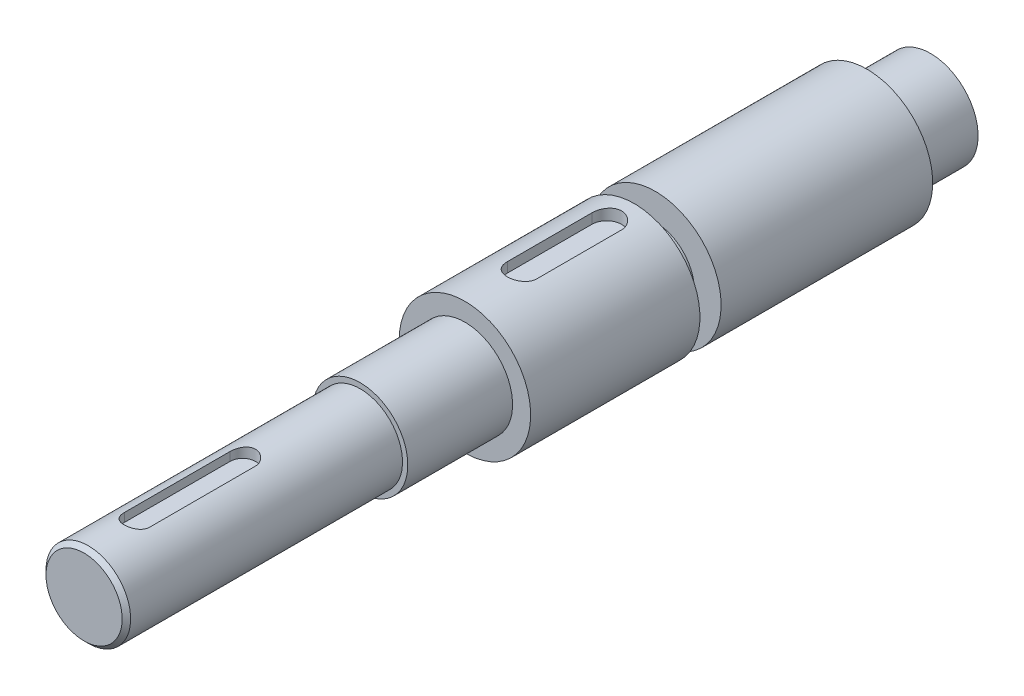
ISO-10303-21;
HEADER;
FILE_DESCRIPTION(('STEP AP214'),'2;1');
FILE_NAME('part.step','',(''),(''),'','','');
FILE_SCHEMA(('AUTOMOTIVE_DESIGN { 1 0 10303 214 1 1 1 1 }'));
ENDSEC;
DATA;
#1=APPLICATION_CONTEXT('core data for automotive mechanical design processes');
#2=APPLICATION_PROTOCOL_DEFINITION('international standard','automotive_design',2000,#1);
#3=PRODUCT_CONTEXT('',#1,'mechanical');
#4=PRODUCT('Part','Part','',(#3));
#5=PRODUCT_RELATED_PRODUCT_CATEGORY('part','',(#4));
#6=PRODUCT_DEFINITION_FORMATION('','',#4);
#7=PRODUCT_DEFINITION_CONTEXT('part definition',#1,'design');
#8=PRODUCT_DEFINITION('design','',#6,#7);
#9=PRODUCT_DEFINITION_SHAPE('','',#8);
#10=(LENGTH_UNIT() NAMED_UNIT(*) SI_UNIT(.MILLI.,.METRE.));
#11=(NAMED_UNIT(*) PLANE_ANGLE_UNIT() SI_UNIT($,.RADIAN.));
#12=(NAMED_UNIT(*) SI_UNIT($,.STERADIAN.) SOLID_ANGLE_UNIT());
#13=UNCERTAINTY_MEASURE_WITH_UNIT(LENGTH_MEASURE(1.E-05),#10,'distance_accuracy_value','');
#14=(GEOMETRIC_REPRESENTATION_CONTEXT(3) GLOBAL_UNCERTAINTY_ASSIGNED_CONTEXT((#13)) GLOBAL_UNIT_ASSIGNED_CONTEXT((#10,
#11,#12)) REPRESENTATION_CONTEXT('',''));
#15=CARTESIAN_POINT('',(0.,0.,0.));
#16=DIRECTION('',(0.,0.,1.));
#17=DIRECTION('',(1.,0.,0.));
#18=AXIS2_PLACEMENT_3D('',#15,#16,#17);
#19=CARTESIAN_POINT('',(0.,0.,0.));
#20=DIRECTION('',(0.,0.,-1.));
#21=DIRECTION('',(-1.,0.,0.));
#22=AXIS2_PLACEMENT_3D('',#19,#20,#21);
#23=CYLINDRICAL_SURFACE('',#22,31.0462161840448);
#24=CARTESIAN_POINT('',(0.,0.,140.));
#25=DIRECTION('',(0.,0.,-1.));
#26=DIRECTION('',(-1.,0.,0.));
#27=AXIS2_PLACEMENT_3D('',#24,#25,#26);
#28=CIRCLE('',#27,31.0462161840448);
#29=CARTESIAN_POINT('',(-31.0462161840448,0.,140.));
#30=VERTEX_POINT('',#29);
#31=EDGE_CURVE('E199',#30,#30,#28,.T.);
#32=ORIENTED_EDGE('',*,*,#31,.F.);
#33=EDGE_LOOP('',(#32));
#34=FACE_BOUND('',#33,.T.);
#35=CARTESIAN_POINT('',(0.,0.,220.));
#36=DIRECTION('',(0.,0.,-1.));
#37=DIRECTION('',(-1.,0.,0.));
#38=AXIS2_PLACEMENT_3D('',#35,#36,#37);
#39=CIRCLE('',#38,31.0462161840448);
#40=CARTESIAN_POINT('',(-31.0462161840447,0.,220.));
#41=VERTEX_POINT('',#40);
#42=EDGE_CURVE('E203',#41,#41,#39,.T.);
#43=ORIENTED_EDGE('',*,*,#42,.T.);
#44=EDGE_LOOP('',(#43));
#45=FACE_BOUND('',#44,.T.);
#46=CARTESIAN_POINT('',(7.00000000000025,30.2467773381965,153.));
#47=CARTESIAN_POINT('',(7.0000239199198,30.2467574455834,152.805798291076));
#48=CARTESIAN_POINT('',(6.9919194202463,30.2486469948294,152.611603461748));
#49=CARTESIAN_POINT('',(6.95962897307481,30.2561003798817,152.224653673244));
#50=CARTESIAN_POINT('',(6.93544535717896,30.2616636829632,152.031898509402));
#51=CARTESIAN_POINT('',(6.87122788254649,30.2763073077124,151.649529930742));
#52=CARTESIAN_POINT('',(6.83122167125654,30.285381494077,151.459911633672));
#53=CARTESIAN_POINT('',(6.73568941566803,30.3067721313322,151.084813621907));
#54=CARTESIAN_POINT('',(6.68016323652484,30.3190886103934,150.899333943186));
#55=CARTESIAN_POINT('',(6.55403762524998,30.3466025580059,150.533837009143));
#56=CARTESIAN_POINT('',(6.4834411993063,30.3617994519093,150.353818672569));
#57=CARTESIAN_POINT('',(6.32767380472778,30.3946445663342,150.000356997992));
#58=CARTESIAN_POINT('',(6.24249743726262,30.41229369444,149.826916124735));
#59=CARTESIAN_POINT('',(6.058226302515,30.4495363213094,149.487861704012));
#60=CARTESIAN_POINT('',(5.95913445500535,30.4691294119346,149.322246524262));
#61=CARTESIAN_POINT('',(5.74767181387971,30.5097263035459,148.999818402501));
#62=CARTESIAN_POINT('',(5.63529604305663,30.5307306320128,148.843008792418));
#63=CARTESIAN_POINT('',(5.39619738924341,30.5739035083762,148.536889021269));
#64=CARTESIAN_POINT('',(5.26927773554923,30.5960851207176,148.387734359963));
#65=CARTESIAN_POINT('',(5.00336373062934,30.6406930007177,148.100544591083));
#66=CARTESIAN_POINT('',(4.86436491832808,30.6631193560682,147.9625136283));
#67=CARTESIAN_POINT('',(4.57528762147346,30.7075830785935,147.698581210576));
#68=CARTESIAN_POINT('',(4.42521144717789,30.7296205256965,147.572677239025));
#69=CARTESIAN_POINT('',(4.11488946773836,30.7727114118001,147.333780659002));
#70=CARTESIAN_POINT('',(3.95463993576943,30.7937644852316,147.220792825069));
#71=CARTESIAN_POINT('',(3.62326319437836,30.8345207802298,147.007402351425));
#72=CARTESIAN_POINT('',(3.45203539587699,30.8542065257863,146.907152487076));
#73=CARTESIAN_POINT('',(3.10150020504033,30.8914113633821,146.721462338761));
#74=CARTESIAN_POINT('',(2.92219274994401,30.9089304385871,146.636022169858));
#75=CARTESIAN_POINT('',(2.55678717062994,30.9412994435502,146.480625043245));
#76=CARTESIAN_POINT('',(2.37069010285869,30.9561497864434,146.410665688627));
#77=CARTESIAN_POINT('',(1.99301512918176,30.9827574854302,146.286775285086));
#78=CARTESIAN_POINT('',(1.80143719905067,30.9945148278504,146.232844307021));
#79=CARTESIAN_POINT('',(1.41743057993197,31.0144285430415,146.142218955206));
#80=CARTESIAN_POINT('',(1.22506884240001,31.0226414688129,146.105253234425));
#81=CARTESIAN_POINT('',(0.837809814232782,31.0355142323855,146.0475617936));
#82=CARTESIAN_POINT('',(0.64291258198073,31.0401741518526,146.026835700286));
#83=CARTESIAN_POINT('',(0.252028400299054,31.0458084692355,146.00179784405));
#84=CARTESIAN_POINT('',(0.0560415355793976,31.0467831497444,145.997484822532));
#85=CARTESIAN_POINT('',(-0.335585865255178,31.0450199514183,146.005306349714));
#86=CARTESIAN_POINT('',(-0.531226404814752,31.0422821097193,146.017440733892));
#87=CARTESIAN_POINT('',(-0.917154406456488,31.0332554465521,146.057682040166));
#88=CARTESIAN_POINT('',(-1.10747435762546,31.0270324320528,146.085493018551));
#89=CARTESIAN_POINT('',(-1.48510840592587,31.0112514900901,146.156654146875));
#90=CARTESIAN_POINT('',(-1.67242152337614,31.0016924978819,146.20000925816));
#91=CARTESIAN_POINT('',(-2.04265072617845,30.9795013884971,146.301907982368));
#92=CARTESIAN_POINT('',(-2.22556746231013,30.9668697292726,146.360449332012));
#93=CARTESIAN_POINT('',(-2.58579336701719,30.9388728505319,146.492276921311));
#94=CARTESIAN_POINT('',(-2.76310242304776,30.9235075761935,146.565563456681));
#95=CARTESIAN_POINT('',(-3.11229852370488,30.8903243955608,146.726971572637));
#96=CARTESIAN_POINT('',(-3.28413206752584,30.8724881797754,146.815205111888));
#97=CARTESIAN_POINT('',(-3.61971452991323,30.8349429735755,147.005431104968));
#98=CARTESIAN_POINT('',(-3.78346604109743,30.8152345897416,147.107419106831));
#99=CARTESIAN_POINT('',(-4.10195322052647,30.7744587081003,147.324514370381));
#100=CARTESIAN_POINT('',(-4.25668493570263,30.7533906227796,147.439627319921));
#101=CARTESIAN_POINT('',(-4.5560102704092,30.7104732371362,147.682118996344));
#102=CARTESIAN_POINT('',(-4.70060734848129,30.6886242071996,147.809493503288));
#103=CARTESIAN_POINT('',(-4.981911972579,30.6442298522696,148.078689741477));
#104=CARTESIAN_POINT('',(-5.11837058308632,30.6216798865012,148.220770970301));
#105=CARTESIAN_POINT('',(-5.37881495990919,30.5770068074307,148.51590912373));
#106=CARTESIAN_POINT('',(-5.5028051518225,30.554883544942,148.66896212069));
#107=CARTESIAN_POINT('',(-5.73759127055969,30.5116674111876,148.985171340518));
#108=CARTESIAN_POINT('',(-5.84837848253314,30.4905752258593,149.148334129726));
#109=CARTESIAN_POINT('',(-6.0558348246162,30.4500504923313,149.483511043996));
#110=CARTESIAN_POINT('',(-6.15250936915881,30.4306173088372,149.655521740056));
#111=CARTESIAN_POINT('',(-6.33145928604448,30.3938899575611,150.008033884803));
#112=CARTESIAN_POINT('',(-6.41367131904218,30.3766052916618,150.188568495276));
#113=CARTESIAN_POINT('',(-6.56251958230933,30.3447964303047,150.556103760492));
#114=CARTESIAN_POINT('',(-6.62916196132427,30.3302711455409,150.74310182909));
#115=CARTESIAN_POINT('',(-6.74631303091165,30.3044287062039,151.122086352806));
#116=CARTESIAN_POINT('',(-6.79683844670633,30.2931082272565,151.314067411605));
#117=CARTESIAN_POINT('',(-6.88140957333259,30.2740089940214,151.701718936996));
#118=CARTESIAN_POINT('',(-6.91546306293057,30.2662285680686,151.897387616685));
#119=CARTESIAN_POINT('',(-6.96074769695719,30.2558414999391,152.244392813603));
#120=CARTESIAN_POINT('',(-6.9754730447401,30.2524461216724,152.395259574937));
#121=CARTESIAN_POINT('',(-6.99509448815791,30.2479125587422,152.697413144234));
#122=CARTESIAN_POINT('',(-7.00000683711061,30.2467706416981,152.848698841324));
#123=CARTESIAN_POINT('',(-6.99999999999975,30.2467773381967,153.));
#124=B_SPLINE_CURVE_WITH_KNOTS('',3,(#46,#47,#48,#49,#50,#51,#52,#53,#54,#55,#56,#57,#58,#59,
#60,#61,#62,#63,#64,#65,#66,#67,#68,#69,#70,#71,#72,#73,#74,#75,#76,#77,#78,#79,#80,#81,#82,#83,
#84,#85,#86,#87,#88,#89,#90,#91,#92,#93,#94,#95,#96,#97,#98,#99,#100,#101,#102,#103,#104,#105,
#106,#107,#108,#109,#110,#111,#112,#113,#114,#115,#116,#117,#118,#119,#120,#121,#122,#123),
.UNSPECIFIED.,.F.,.F.,(4,2,2,2,2,2,2,2,2,2,2,2,2,2,2,2,2,2,2,2,2,2,2,2,2,2,2,2,2,2,2,2,2,2,2,2,
2,2,4),(0.,0.582416478854942,1.1647485210153,1.74606749524719,2.32739152040324,2.90859969218114,
3.49002354789967,4.07132558991947,4.65284612810097,5.24345467259487,5.83428227528465,
6.42498700321636,7.01590938794055,7.613358051113,8.21081135593759,8.80817209172211,
9.40553546824759,9.9929794947503,10.5804100184128,11.1677954955453,11.755175097163,
12.3318205873246,12.9086502941248,13.4853940824775,14.0621494386057,14.6434331528452,
15.2245291699617,15.8058779759733,16.3870274153369,16.9811807236283,17.5751223904631,
18.1694539522804,18.7635568915699,19.3602002489999,19.9566075810857,20.5523939684355,
21.1478987239513,21.6024416947441,22.0562311774931),.UNSPECIFIED.);
#125=CARTESIAN_POINT('',(7.00000000000025,30.2467773381965,153.));
#126=VERTEX_POINT('',#125);
#127=CARTESIAN_POINT('',(-6.99999999999975,30.2467773381967,153.));
#128=VERTEX_POINT('',#127);
#129=EDGE_CURVE('E263',#126,#128,#124,.T.);
#130=ORIENTED_EDGE('',*,*,#129,.F.);
#131=DIRECTION('',(0.,0.,-1.));
#132=VECTOR('',#131,1.);
#133=CARTESIAN_POINT('',(7.00000000000027,30.2467773381965,0.));
#134=LINE('',#133,#132);
#135=CARTESIAN_POINT('',(7.00000000000024,30.2467773381966,193.));
#136=VERTEX_POINT('',#135);
#137=EDGE_CURVE('E296',#136,#126,#134,.T.);
#138=ORIENTED_EDGE('',*,*,#137,.F.);
#139=CARTESIAN_POINT('',(-6.99999999999975,30.2467773381967,193.));
#140=CARTESIAN_POINT('',(-7.0000239199193,30.2467574455835,193.194201708924));
#141=CARTESIAN_POINT('',(-6.9919194202458,30.2486469948295,193.388396538252));
#142=CARTESIAN_POINT('',(-6.95962897307431,30.2561003798818,193.775346326756));
#143=CARTESIAN_POINT('',(-6.93544535717846,30.2616636829633,193.968101490598));
#144=CARTESIAN_POINT('',(-6.87122788254599,30.2763073077125,194.350470069258));
#145=CARTESIAN_POINT('',(-6.83122167125604,30.2853814940771,194.540088366328));
#146=CARTESIAN_POINT('',(-6.73568941566753,30.3067721313323,194.915186378093));
#147=CARTESIAN_POINT('',(-6.68016323652433,30.3190886103935,195.100666056814));
#148=CARTESIAN_POINT('',(-6.55403762524947,30.346602558006,195.466162990857));
#149=CARTESIAN_POINT('',(-6.4834411993058,30.3617994519094,195.646181327431));
#150=CARTESIAN_POINT('',(-6.32767380472728,30.3946445663343,195.999643002008));
#151=CARTESIAN_POINT('',(-6.24249743726211,30.4122936944401,196.173083875265));
#152=CARTESIAN_POINT('',(-6.0582263025145,30.4495363213095,196.512138295988));
#153=CARTESIAN_POINT('',(-5.95913445500485,30.4691294119347,196.677753475738));
#154=CARTESIAN_POINT('',(-5.7476718138792,30.509726303546,197.000181597499));
#155=CARTESIAN_POINT('',(-5.63529604305612,30.5307306320129,197.156991207582));
#156=CARTESIAN_POINT('',(-5.3961973892429,30.5739035083763,197.463110978731));
#157=CARTESIAN_POINT('',(-5.26927773554871,30.5960851207177,197.612265640037));
#158=CARTESIAN_POINT('',(-5.00336373062881,30.6406930007178,197.899455408917));
#159=CARTESIAN_POINT('',(-4.86436491832755,30.6631193560683,198.037486371701));
#160=CARTESIAN_POINT('',(-4.57528762147293,30.7075830785936,198.301418789424));
#161=CARTESIAN_POINT('',(-4.42521144717735,30.7296205256966,198.427322760975));
#162=CARTESIAN_POINT('',(-4.11488946773781,30.7727114118002,198.666219340998));
#163=CARTESIAN_POINT('',(-3.95463993576888,30.7937644852316,198.779207174931));
#164=CARTESIAN_POINT('',(-3.62326319437781,30.8345207802299,198.992597648575));
#165=CARTESIAN_POINT('',(-3.45203539587644,30.8542065257864,199.092847512924));
#166=CARTESIAN_POINT('',(-3.10150020503978,30.8914113633821,199.278537661239));
#167=CARTESIAN_POINT('',(-2.92219274994346,30.9089304385872,199.363977830142));
#168=CARTESIAN_POINT('',(-2.55678717062939,30.9412994435503,199.519374956755));
#169=CARTESIAN_POINT('',(-2.37069010285815,30.9561497864435,199.589334311373));
#170=CARTESIAN_POINT('',(-1.99301512918121,30.9827574854303,199.713224714914));
#171=CARTESIAN_POINT('',(-1.80143719905012,30.9945148278505,199.767155692979));
#172=CARTESIAN_POINT('',(-1.41743057993142,31.0144285430415,199.857781044794));
#173=CARTESIAN_POINT('',(-1.22506884239947,31.0226414688129,199.894746765575));
#174=CARTESIAN_POINT('',(-0.837809814232241,31.0355142323855,199.9524382064));
#175=CARTESIAN_POINT('',(-0.642912581980186,31.0401741518527,199.973164299714));
#176=CARTESIAN_POINT('',(-0.252028400298507,31.0458084692355,199.998202155951));
#177=CARTESIAN_POINT('',(-0.0560415355788504,31.0467831497444,200.002515177468));
#178=CARTESIAN_POINT('',(0.335585865255725,31.0450199514183,199.994693650286));
#179=CARTESIAN_POINT('',(0.531226404815299,31.0422821097193,199.982559266108));
#180=CARTESIAN_POINT('',(0.917154406457035,31.0332554465521,199.942317959834));
#181=CARTESIAN_POINT('',(1.10747435762601,31.0270324320528,199.914506981449));
#182=CARTESIAN_POINT('',(1.48510840592641,31.0112514900901,199.843345853125));
#183=CARTESIAN_POINT('',(1.67242152337669,31.0016924978819,199.79999074184));
#184=CARTESIAN_POINT('',(2.04265072617899,30.979501388497,199.698092017632));
#185=CARTESIAN_POINT('',(2.22556746231066,30.9668697292726,199.639550667988));
#186=CARTESIAN_POINT('',(2.58579336701772,30.9388728505318,199.507723078689));
#187=CARTESIAN_POINT('',(2.7631024230483,30.9235075761934,199.434436543319));
#188=CARTESIAN_POINT('',(3.11229852370541,30.8903243955608,199.273028427363));
#189=CARTESIAN_POINT('',(3.28413206752637,30.8724881797753,199.184794888112));
#190=CARTESIAN_POINT('',(3.61971452991376,30.8349429735754,198.994568895032));
#191=CARTESIAN_POINT('',(3.78346604109795,30.8152345897415,198.892580893169));
#192=CARTESIAN_POINT('',(4.101953220527,30.7744587081002,198.675485629619));
#193=CARTESIAN_POINT('',(4.25668493570316,30.7533906227795,198.560372680079));
#194=CARTESIAN_POINT('',(4.55601027040972,30.7104732371361,198.317881003656));
#195=CARTESIAN_POINT('',(4.7006073484818,30.6886242071995,198.190506496712));
#196=CARTESIAN_POINT('',(4.98191197257951,30.6442298522695,197.921310258523));
#197=CARTESIAN_POINT('',(5.11837058308684,30.6216798865011,197.779229029699));
#198=CARTESIAN_POINT('',(5.37881495990972,30.5770068074306,197.48409087627));
#199=CARTESIAN_POINT('',(5.50280515182302,30.5548835449419,197.33103787931));
#200=CARTESIAN_POINT('',(5.7375912705602,30.5116674111875,197.014828659482));
#201=CARTESIAN_POINT('',(5.84837848253365,30.4905752258592,196.851665870274));
#202=CARTESIAN_POINT('',(6.0558348246167,30.4500504923312,196.516488956004));
#203=CARTESIAN_POINT('',(6.15250936915931,30.4306173088371,196.344478259944));
#204=CARTESIAN_POINT('',(6.33145928604498,30.393889957561,195.991966115197));
#205=CARTESIAN_POINT('',(6.41367131904269,30.3766052916617,195.811431504724));
#206=CARTESIAN_POINT('',(6.56251958230985,30.3447964303046,195.443896239508));
#207=CARTESIAN_POINT('',(6.62916196132479,30.3302711455408,195.25689817091));
#208=CARTESIAN_POINT('',(6.74631303091217,30.3044287062038,194.877913647193));
#209=CARTESIAN_POINT('',(6.79683844670685,30.2931082272563,194.685932588395));
#210=CARTESIAN_POINT('',(6.8814095733331,30.2740089940213,194.298281063004));
#211=CARTESIAN_POINT('',(6.91546306293108,30.2662285680685,194.102612383315));
#212=CARTESIAN_POINT('',(6.9607476969577,30.255841499939,193.755607186397));
#213=CARTESIAN_POINT('',(6.9754730447406,30.2524461216723,193.604740425063));
#214=CARTESIAN_POINT('',(6.9950944881584,30.2479125587421,193.302586855766));
#215=CARTESIAN_POINT('',(7.0000068371111,30.246770641698,193.151301158676));
#216=CARTESIAN_POINT('',(7.00000000000024,30.2467773381966,193.));
#217=B_SPLINE_CURVE_WITH_KNOTS('',3,(#139,#140,#141,#142,#143,#144,#145,#146,#147,#148,#149,
#150,#151,#152,#153,#154,#155,#156,#157,#158,#159,#160,#161,#162,#163,#164,#165,#166,#167,#168,
#169,#170,#171,#172,#173,#174,#175,#176,#177,#178,#179,#180,#181,#182,#183,#184,#185,#186,#187,
#188,#189,#190,#191,#192,#193,#194,#195,#196,#197,#198,#199,#200,#201,#202,#203,#204,#205,#206,
#207,#208,#209,#210,#211,#212,#213,#214,#215,#216),.UNSPECIFIED.,.F.,.F.,(4,2,2,2,2,2,2,2,2,2,2,
2,2,2,2,2,2,2,2,2,2,2,2,2,2,2,2,2,2,2,2,2,2,2,2,2,2,2,4),(0.,0.582416478854915,1.1647485210153,
1.74606749524719,2.32739152040324,2.90859969218112,3.49002354789965,4.07132558991945,
4.65284612810095,5.2434546725949,5.83428227528465,6.42498700321639,7.01590938794057,
7.61335805111302,8.2108113559376,8.80817209172211,9.40553546824759,9.9929794947503,
10.5804100184128,11.1677954955454,11.755175097163,12.3318205873246,12.9086502941248,
13.4853940824775,14.0621494386057,14.6434331528452,15.2245291699617,15.8058779759733,
16.3870274153369,16.9811807236283,17.5751223904631,18.1694539522804,18.7635568915698,
19.3602002489999,19.9566075810857,20.5523939684356,21.1478987239514,21.6024416947441,
22.056231177493),.UNSPECIFIED.);
#218=CARTESIAN_POINT('',(-6.99999999999976,30.2467773381967,193.));
#219=VERTEX_POINT('',#218);
#220=EDGE_CURVE('E289',#219,#136,#217,.T.);
#221=ORIENTED_EDGE('',*,*,#220,.F.);
#222=DIRECTION('',(0.,0.,-1.));
#223=VECTOR('',#222,1.);
#224=CARTESIAN_POINT('',(-6.99999999999973,30.2467773381967,0.));
#225=LINE('',#224,#223);
#226=EDGE_CURVE('E137',#128,#219,#225,.F.);
#227=ORIENTED_EDGE('',*,*,#226,.F.);
#228=EDGE_LOOP('',(#130,#138,#221,#227));
#229=FACE_BOUND('',#228,.T.);
#230=ADVANCED_FACE('F47',(#34,#45,#229),#23,.T.);
#231=CARTESIAN_POINT('',(0.,0.,0.));
#232=DIRECTION('',(0.,0.,-1.));
#233=DIRECTION('',(-1.,0.,0.));
#234=AXIS2_PLACEMENT_3D('',#231,#232,#233);
#235=CYLINDRICAL_SURFACE('',#234,20.);
#236=CARTESIAN_POINT('',(0.,0.,398.));
#237=DIRECTION('',(0.,0.,-1.));
#238=DIRECTION('',(-1.,0.,0.));
#239=AXIS2_PLACEMENT_3D('',#236,#237,#238);
#240=CIRCLE('',#239,20.);
#241=CARTESIAN_POINT('',(-20.,0.,398.));
#242=VERTEX_POINT('',#241);
#243=EDGE_CURVE('E57',#242,#242,#240,.T.);
#244=ORIENTED_EDGE('',*,*,#243,.T.);
#245=EDGE_LOOP('',(#244));
#246=FACE_BOUND('',#245,.T.);
#247=CARTESIAN_POINT('',(0.,0.,269.514398680716));
#248=DIRECTION('',(0.,0.,-1.));
#249=DIRECTION('',(-1.,0.,0.));
#250=AXIS2_PLACEMENT_3D('',#247,#248,#249);
#251=CIRCLE('',#250,20.);
#252=CARTESIAN_POINT('',(-20.,0.,269.514398680716));
#253=VERTEX_POINT('',#252);
#254=EDGE_CURVE('E215',#253,#253,#251,.T.);
#255=ORIENTED_EDGE('',*,*,#254,.F.);
#256=EDGE_LOOP('',(#255));
#257=FACE_BOUND('',#256,.T.);
#258=CARTESIAN_POINT('',(6.00000000000005,19.0787840283389,325.));
#259=CARTESIAN_POINT('',(6.00002230630959,19.0787603919218,324.835332005089));
#260=CARTESIAN_POINT('',(5.99322212828866,19.0809150948054,324.67067261307));
#261=CARTESIAN_POINT('',(5.96614198358444,19.089408588524,324.342610571615));
#262=CARTESIAN_POINT('',(5.94586504749988,19.0957464386677,324.179207647986));
#263=CARTESIAN_POINT('',(5.89206455668665,19.1124126760415,323.855233206316));
#264=CARTESIAN_POINT('',(5.85857463708943,19.1227309292375,323.694655572036));
#265=CARTESIAN_POINT('',(5.77865096251384,19.1470349488516,323.377037691332));
#266=CARTESIAN_POINT('',(5.73221686903437,19.1610208111801,323.219997537531));
#267=CARTESIAN_POINT('',(5.62682620459489,19.1922338155173,322.910617439276));
#268=CARTESIAN_POINT('',(5.56787702452558,19.2094590438083,322.758274781224));
#269=CARTESIAN_POINT('',(5.43788252899629,19.2466621419291,322.459125857098));
#270=CARTESIAN_POINT('',(5.36683271334061,19.2666410353109,322.312321675672));
#271=CARTESIAN_POINT('',(5.21317247195198,19.3087849542851,322.025215054747));
#272=CARTESIAN_POINT('',(5.13056139609836,19.3309501027959,321.88491298147));
#273=CARTESIAN_POINT('',(4.95431913401976,19.3768680311909,321.611612201325));
#274=CARTESIAN_POINT('',(4.86068378223775,19.4006214097184,321.478616283128));
#275=CARTESIAN_POINT('',(4.66024014290226,19.4497584548899,321.21713642677));
#276=CARTESIAN_POINT('',(4.55313526362692,19.4751691904069,321.088884847802));
#277=CARTESIAN_POINT('',(4.32860344600267,19.5263015189751,320.841746062991));
#278=CARTESIAN_POINT('',(4.2111729265472,19.5520232171847,320.722862133329));
#279=CARTESIAN_POINT('',(3.96676059198594,19.6030710031715,320.495258604878));
#280=CARTESIAN_POINT('',(3.83977871873941,19.6283970885393,320.386539067971));
#281=CARTESIAN_POINT('',(3.57705696576213,19.6779706962222,320.179980745528));
#282=CARTESIAN_POINT('',(3.44131715512972,19.7022182270444,320.082141874161));
#283=CARTESIAN_POINT('',(3.15899953964079,19.7494715734221,319.89609023174));
#284=CARTESIAN_POINT('',(3.01225429870654,19.7724407517413,319.808121953698));
#285=CARTESIAN_POINT('',(2.71155717798054,19.8159158974823,319.644936205945));
#286=CARTESIAN_POINT('',(2.557607989951,19.8364227748921,319.569714021433));
#287=CARTESIAN_POINT('',(2.24348996032487,19.8744001644265,319.432583560629));
#288=CARTESIAN_POINT('',(2.08331997555624,19.8918701152059,319.370677745232));
#289=CARTESIAN_POINT('',(1.75801430484779,19.923254535561,319.260762497544));
#290=CARTESIAN_POINT('',(1.59288079897396,19.9371705413066,319.212747060032));
#291=CARTESIAN_POINT('',(1.26354510595582,19.960709769643,319.132174453272));
#292=CARTESIAN_POINT('',(1.09944808925085,19.9704430293701,319.099219373042));
#293=CARTESIAN_POINT('',(0.768952154149012,19.9858966495547,319.047128002714));
#294=CARTESIAN_POINT('',(0.602554181799357,19.9916186120195,319.027986195865));
#295=CARTESIAN_POINT('',(0.26864429974029,19.9988929276978,319.003680035143));
#296=CARTESIAN_POINT('',(0.101132356361035,20.0004451543013,318.998516105694));
#297=CARTESIAN_POINT('',(-0.233720900410804,19.9993350985709,319.002216405078));
#298=CARTESIAN_POINT('',(-0.401062216878449,19.9966728935831,319.011080376463));
#299=CARTESIAN_POINT('',(-0.728949940400253,19.9873626800315,319.042242211602));
#300=CARTESIAN_POINT('',(-0.889542117296593,19.9808452710305,319.064100009983));
#301=CARTESIAN_POINT('',(-1.208300210149,19.9641050678088,319.120695481758));
#302=CARTESIAN_POINT('',(-1.36646528055409,19.9538810115069,319.155437542225));
#303=CARTESIAN_POINT('',(-1.67917461818932,19.9300014175933,319.23749230161));
#304=CARTESIAN_POINT('',(-1.83372008335725,19.916347033335,319.284800775723));
#305=CARTESIAN_POINT('',(-2.13828018933728,19.8859545815151,319.391630271063));
#306=CARTESIAN_POINT('',(-2.28829310223865,19.8692153547843,319.451155883997));
#307=CARTESIAN_POINT('',(-2.58443507880936,19.8328818557961,319.582690579539));
#308=CARTESIAN_POINT('',(-2.73050124822113,19.8132575095082,319.654832897198));
#309=CARTESIAN_POINT('',(-3.01609632375413,19.7717979578185,319.810623147329));
#310=CARTESIAN_POINT('',(-3.15562296424235,19.7499619943591,319.894275028384));
#311=CARTESIAN_POINT('',(-3.42724384686886,19.704643118031,320.072486982441));
#312=CARTESIAN_POINT('',(-3.55933800314021,19.681160186142,320.167047181428));
#313=CARTESIAN_POINT('',(-3.81531376455349,19.6331439703208,320.366458678429));
#314=CARTESIAN_POINT('',(-3.93919513006478,19.6086106557752,320.471310276501));
#315=CARTESIAN_POINT('',(-4.18263653591647,19.5581593507452,320.694897243463));
#316=CARTESIAN_POINT('',(-4.30184428600929,19.5322244988475,320.814012679474));
#317=CARTESIAN_POINT('',(-4.52981041510263,19.4806179410542,321.061833503502));
#318=CARTESIAN_POINT('',(-4.63857214120811,19.454946153239,321.190535796081));
#319=CARTESIAN_POINT('',(-4.84504126060961,19.4045581786368,321.456840396238));
#320=CARTESIAN_POINT('',(-4.94274124635227,19.3798426394128,321.594448571901));
#321=CARTESIAN_POINT('',(-5.12628631686319,19.3321023379674,321.877559092333));
#322=CARTESIAN_POINT('',(-5.21213600998873,19.3090769201297,322.023058337578));
#323=CARTESIAN_POINT('',(-5.37223080367561,19.2651525602885,322.322635135093));
#324=CARTESIAN_POINT('',(-5.44634371437397,19.2442786555292,322.476787078659));
#325=CARTESIAN_POINT('',(-5.58122691640498,19.2055937237889,322.791121841361));
#326=CARTESIAN_POINT('',(-5.64200266456198,19.1877814448102,322.951302162478));
#327=CARTESIAN_POINT('',(-5.74966145349626,19.1557967477957,323.27643211835));
#328=CARTESIAN_POINT('',(-5.79655912825483,19.1416204978023,323.441376526563));
#329=CARTESIAN_POINT('',(-5.87609462586433,19.1173543231183,323.774893180451));
#330=CARTESIAN_POINT('',(-5.90873902604372,19.1072625137754,323.943463715048));
#331=CARTESIAN_POINT('',(-5.95603131732396,19.0925703406668,324.259937070236));
#332=CARTESIAN_POINT('',(-5.9725197126242,19.0874107715083,324.40754170936));
#333=CARTESIAN_POINT('',(-5.9945026191415,19.0805126306352,324.703427112475));
#334=CARTESIAN_POINT('',(-6.00001329545503,19.0787690288453,324.851706559575));
#335=CARTESIAN_POINT('',(-5.99999999999995,19.0787840283389,325.));
#336=B_SPLINE_CURVE_WITH_KNOTS('',3,(#258,#259,#260,#261,#262,#263,#264,#265,#266,#267,#268,
#269,#270,#271,#272,#273,#274,#275,#276,#277,#278,#279,#280,#281,#282,#283,#284,#285,#286,#287,
#288,#289,#290,#291,#292,#293,#294,#295,#296,#297,#298,#299,#300,#301,#302,#303,#304,#305,#306,
#307,#308,#309,#310,#311,#312,#313,#314,#315,#316,#317,#318,#319,#320,#321,#322,#323,#324,#325,
#326,#327,#328,#329,#330,#331,#332,#333,#334,#335),.UNSPECIFIED.,.F.,.F.,(4,2,2,2,2,2,2,2,2,2,2,
2,2,2,2,2,2,2,2,2,2,2,2,2,2,2,2,2,2,2,2,2,2,2,2,2,2,2,4),(0.,0.493836284878948,
0.987561555412104,1.48003801924597,1.97252736296403,2.46472666795176,2.95710942192589,
3.44951987503686,3.94211698773,4.44857898474597,4.95521732942469,5.46185875834844,
5.96849619046397,6.48574341264197,7.00279888450883,7.51994982748056,8.03687685551439,
8.53921958328374,9.04136157401785,9.54351881163817,10.0456668334346,10.5317065218739,
11.0179118582603,11.5039539397551,11.9901790315928,12.4818885441265,12.9737671698834,
13.4656514771114,13.9575501300996,14.4684682486942,14.9792221093922,15.4903160010786,
16.001210574562,16.517502934493,17.0335836608614,17.549118241575,18.0644146711719,
18.5098131233959,18.9545552237082),.UNSPECIFIED.);
#337=CARTESIAN_POINT('',(6.00000000000005,19.0787840283389,325.));
#338=VERTEX_POINT('',#337);
#339=CARTESIAN_POINT('',(-5.99999999999995,19.0787840283389,325.));
#340=VERTEX_POINT('',#339);
#341=EDGE_CURVE('E219',#338,#340,#336,.T.);
#342=ORIENTED_EDGE('',*,*,#341,.F.);
#343=DIRECTION('',(0.,0.,-1.));
#344=VECTOR('',#343,1.);
#345=CARTESIAN_POINT('',(6.00000000000009,19.0787840283389,0.));
#346=LINE('',#345,#344);
#347=CARTESIAN_POINT('',(6.00000000000005,19.0787840283389,375.));
#348=VERTEX_POINT('',#347);
#349=EDGE_CURVE('E260',#348,#338,#346,.T.);
#350=ORIENTED_EDGE('',*,*,#349,.F.);
#351=CARTESIAN_POINT('',(-5.99999999999995,19.0787840283389,375.));
#352=CARTESIAN_POINT('',(-6.00002230630949,19.0787603919218,375.164667994911));
#353=CARTESIAN_POINT('',(-5.99322212828857,19.0809150948054,375.32932738693));
#354=CARTESIAN_POINT('',(-5.96614198358434,19.0894085885241,375.657389428384));
#355=CARTESIAN_POINT('',(-5.94586504749978,19.0957464386678,375.820792352014));
#356=CARTESIAN_POINT('',(-5.89206455668656,19.1124126760415,376.144766793684));
#357=CARTESIAN_POINT('',(-5.85857463708934,19.1227309292375,376.305344427964));
#358=CARTESIAN_POINT('',(-5.77865096251375,19.1470349488515,376.622962308668));
#359=CARTESIAN_POINT('',(-5.73221686903429,19.1610208111801,376.780002462469));
#360=CARTESIAN_POINT('',(-5.62682620459481,19.1922338155173,377.089382560723));
#361=CARTESIAN_POINT('',(-5.56787702452551,19.2094590438083,377.241725218776));
#362=CARTESIAN_POINT('',(-5.43788252899624,19.2466621419291,377.540874142901));
#363=CARTESIAN_POINT('',(-5.36683271334056,19.2666410353108,377.687678324328));
#364=CARTESIAN_POINT('',(-5.21317247195194,19.3087849542851,377.974784945253));
#365=CARTESIAN_POINT('',(-5.13056139609832,19.3309501027959,378.11508701853));
#366=CARTESIAN_POINT('',(-4.95431913401973,19.3768680311909,378.388387798675));
#367=CARTESIAN_POINT('',(-4.8606837822377,19.4006214097184,378.521383716872));
#368=CARTESIAN_POINT('',(-4.66024014290221,19.4497584548899,378.78286357323));
#369=CARTESIAN_POINT('',(-4.55313526362687,19.4751691904069,378.911115152198));
#370=CARTESIAN_POINT('',(-4.32860344600263,19.5263015189751,379.158253937009));
#371=CARTESIAN_POINT('',(-4.21117292654716,19.5520232171847,379.277137866671));
#372=CARTESIAN_POINT('',(-3.9667605919859,19.6030710031715,379.504741395122));
#373=CARTESIAN_POINT('',(-3.83977871873937,19.6283970885393,379.613460932029));
#374=CARTESIAN_POINT('',(-3.57705696576209,19.6779706962222,379.820019254472));
#375=CARTESIAN_POINT('',(-3.44131715512968,19.7022182270443,379.917858125839));
#376=CARTESIAN_POINT('',(-3.15899953964076,19.7494715734221,380.10390976826));
#377=CARTESIAN_POINT('',(-3.01225429870653,19.7724407517412,380.191878046302));
#378=CARTESIAN_POINT('',(-2.71155717798052,19.8159158974823,380.355063794055));
#379=CARTESIAN_POINT('',(-2.55760798995096,19.8364227748921,380.430285978567));
#380=CARTESIAN_POINT('',(-2.24348996032482,19.8744001644265,380.567416439371));
#381=CARTESIAN_POINT('',(-2.08331997555619,19.8918701152059,380.629322254768));
#382=CARTESIAN_POINT('',(-1.75801430484774,19.923254535561,380.739237502456));
#383=CARTESIAN_POINT('',(-1.59288079897391,19.9371705413066,380.787252939968));
#384=CARTESIAN_POINT('',(-1.26354510595577,19.960709769643,380.867825546728));
#385=CARTESIAN_POINT('',(-1.09944808925081,19.9704430293701,380.900780626958));
#386=CARTESIAN_POINT('',(-0.76895215414897,19.9858966495547,380.952871997286));
#387=CARTESIAN_POINT('',(-0.602554181799311,19.9916186120195,380.972013804135));
#388=CARTESIAN_POINT('',(-0.26864429974024,19.9988929276978,380.996319964857));
#389=CARTESIAN_POINT('',(-0.101132356360984,20.0004451543013,381.001483894306));
#390=CARTESIAN_POINT('',(0.233720900410854,19.9993350985709,380.997783594921));
#391=CARTESIAN_POINT('',(0.401062216878498,19.9966728935831,380.988919623537));
#392=CARTESIAN_POINT('',(0.728949940400306,19.9873626800315,380.957757788398));
#393=CARTESIAN_POINT('',(0.889542117296652,19.9808452710305,380.935899990017));
#394=CARTESIAN_POINT('',(1.20830021014906,19.9641050678088,380.879304518242));
#395=CARTESIAN_POINT('',(1.36646528055414,19.9538810115069,380.844562457775));
#396=CARTESIAN_POINT('',(1.67917461818937,19.9300014175933,380.76250769839));
#397=CARTESIAN_POINT('',(1.83372008335731,19.916347033335,380.715199224277));
#398=CARTESIAN_POINT('',(2.13828018933734,19.8859545815151,380.608369728937));
#399=CARTESIAN_POINT('',(2.2882931022387,19.8692153547843,380.548844116003));
#400=CARTESIAN_POINT('',(2.58443507880941,19.8328818557961,380.417309420461));
#401=CARTESIAN_POINT('',(2.73050124822118,19.8132575095082,380.345167102802));
#402=CARTESIAN_POINT('',(3.01609632375419,19.7717979578185,380.189376852671));
#403=CARTESIAN_POINT('',(3.1556229642424,19.7499619943591,380.105724971616));
#404=CARTESIAN_POINT('',(3.4272438468689,19.704643118031,379.927513017559));
#405=CARTESIAN_POINT('',(3.55933800314025,19.681160186142,379.832952818572));
#406=CARTESIAN_POINT('',(3.81531376455354,19.6331439703208,379.633541321571));
#407=CARTESIAN_POINT('',(3.93919513006483,19.6086106557752,379.528689723499));
#408=CARTESIAN_POINT('',(4.18263653591652,19.5581593507452,379.305102756537));
#409=CARTESIAN_POINT('',(4.30184428600935,19.5322244988475,379.185987320526));
#410=CARTESIAN_POINT('',(4.52981041510268,19.4806179410542,378.938166496498));
#411=CARTESIAN_POINT('',(4.63857214120817,19.454946153239,378.809464203919));
#412=CARTESIAN_POINT('',(4.84504126060966,19.4045581786368,378.543159603762));
#413=CARTESIAN_POINT('',(4.94274124635232,19.3798426394128,378.405551428099));
#414=CARTESIAN_POINT('',(5.12628631686325,19.3321023379674,378.122440907667));
#415=CARTESIAN_POINT('',(5.21213600998879,19.3090769201297,377.976941662422));
#416=CARTESIAN_POINT('',(5.37223080367569,19.2651525602885,377.677364864907));
#417=CARTESIAN_POINT('',(5.44634371437405,19.2442786555292,377.523212921341));
#418=CARTESIAN_POINT('',(5.58122691640506,19.2055937237889,377.208878158639));
#419=CARTESIAN_POINT('',(5.64200266456205,19.1877814448102,377.048697837522));
#420=CARTESIAN_POINT('',(5.74966145349633,19.1557967477957,376.72356788165));
#421=CARTESIAN_POINT('',(5.7965591282549,19.1416204978023,376.558623473437));
#422=CARTESIAN_POINT('',(5.87609462586441,19.1173543231183,376.225106819549));
#423=CARTESIAN_POINT('',(5.90873902604381,19.1072625137754,376.056536284952));
#424=CARTESIAN_POINT('',(5.95603131732405,19.0925703406668,375.740062929764));
#425=CARTESIAN_POINT('',(5.9725197126243,19.0874107715083,375.59245829064));
#426=CARTESIAN_POINT('',(5.9945026191416,19.0805126306352,375.296572887525));
#427=CARTESIAN_POINT('',(6.00001329545513,19.0787690288453,375.148293440425));
#428=CARTESIAN_POINT('',(6.00000000000005,19.0787840283389,375.));
#429=B_SPLINE_CURVE_WITH_KNOTS('',3,(#351,#352,#353,#354,#355,#356,#357,#358,#359,#360,#361,
#362,#363,#364,#365,#366,#367,#368,#369,#370,#371,#372,#373,#374,#375,#376,#377,#378,#379,#380,
#381,#382,#383,#384,#385,#386,#387,#388,#389,#390,#391,#392,#393,#394,#395,#396,#397,#398,#399,
#400,#401,#402,#403,#404,#405,#406,#407,#408,#409,#410,#411,#412,#413,#414,#415,#416,#417,#418,
#419,#420,#421,#422,#423,#424,#425,#426,#427,#428),.UNSPECIFIED.,.F.,.F.,(4,2,2,2,2,2,2,2,2,2,2,
2,2,2,2,2,2,2,2,2,2,2,2,2,2,2,2,2,2,2,2,2,2,2,2,2,2,2,4),(0.,0.493836284878948,
0.987561555412159,1.48003801924597,1.97252736296402,2.46472666795175,2.95710942192582,
3.44951987503678,3.94211698772999,4.44857898474594,4.95521732942466,5.46185875834846,
5.96849619046394,6.48574341264191,7.00279888450882,7.51994982748057,8.0368768555144,
8.53921958328375,9.04136157401786,9.54351881163818,10.0456668334346,10.5317065218739,
11.0179118582603,11.5039539397551,11.9901790315928,12.4818885441265,12.9737671698834,
13.4656514771114,13.9575501300996,14.4684682486942,14.9792221093922,15.4903160010786,
16.001210574562,16.517502934493,17.0335836608613,17.549118241575,18.0644146711719,
18.509813123396,18.9545552237084),.UNSPECIFIED.);
#430=CARTESIAN_POINT('',(-5.99999999999995,19.078784028339,375.));
#431=VERTEX_POINT('',#430);
#432=EDGE_CURVE('E253',#431,#348,#429,.T.);
#433=ORIENTED_EDGE('',*,*,#432,.F.);
#434=DIRECTION('',(0.,0.,-1.));
#435=VECTOR('',#434,1.);
#436=CARTESIAN_POINT('',(-5.99999999999991,19.078784028339,0.));
#437=LINE('',#436,#435);
#438=EDGE_CURVE('E228',#340,#431,#437,.F.);
#439=ORIENTED_EDGE('',*,*,#438,.F.);
#440=EDGE_LOOP('',(#342,#350,#433,#439));
#441=FACE_BOUND('',#440,.T.);
#442=ADVANCED_FACE('F230',(#246,#257,#441),#235,.T.);
#443=CARTESIAN_POINT('',(22.5,0.,0.));
#444=DIRECTION('',(0.,0.,1.));
#445=DIRECTION('',(1.,0.,0.));
#446=AXIS2_PLACEMENT_3D('',#443,#444,#445);
#447=PLANE('',#446);
#448=CARTESIAN_POINT('',(0.,0.,0.));
#449=DIRECTION('',(0.,0.,-1.));
#450=DIRECTION('',(-1.,0.,0.));
#451=AXIS2_PLACEMENT_3D('',#448,#449,#450);
#452=CIRCLE('',#451,22.5);
#453=CARTESIAN_POINT('',(-22.5,0.,0.));
#454=VERTEX_POINT('',#453);
#455=EDGE_CURVE('E175',#454,#454,#452,.T.);
#456=ORIENTED_EDGE('',*,*,#455,.T.);
#457=EDGE_LOOP('',(#456));
#458=FACE_BOUND('',#457,.T.);
#459=ADVANCED_FACE('F317',(#458),#447,.F.);
#460=CARTESIAN_POINT('',(20.0000000000001,0.,400.));
#461=DIRECTION('',(0.,0.,-1.));
#462=DIRECTION('',(-1.,0.,0.));
#463=AXIS2_PLACEMENT_3D('',#460,#461,#462);
#464=PLANE('',#463);
#465=CARTESIAN_POINT('',(0.,0.,400.));
#466=DIRECTION('',(0.,0.,-1.));
#467=DIRECTION('',(-1.,0.,0.));
#468=AXIS2_PLACEMENT_3D('',#465,#466,#467);
#469=CIRCLE('',#468,18.);
#470=CARTESIAN_POINT('',(-17.9999999999999,0.,400.));
#471=VERTEX_POINT('',#470);
#472=EDGE_CURVE('E11',#471,#471,#469,.F.);
#473=ORIENTED_EDGE('',*,*,#472,.T.);
#474=EDGE_LOOP('',(#473));
#475=FACE_BOUND('',#474,.T.);
#476=ADVANCED_FACE('F455',(#475),#464,.F.);
#477=CARTESIAN_POINT('',(22.5,0.,269.514398680716));
#478=DIRECTION('',(0.,0.,-1.));
#479=DIRECTION('',(-1.,0.,0.));
#480=AXIS2_PLACEMENT_3D('',#477,#478,#479);
#481=PLANE('',#480);
#482=CARTESIAN_POINT('',(0.,0.,269.514398680716));
#483=DIRECTION('',(0.,0.,-1.));
#484=DIRECTION('',(-1.,0.,0.));
#485=AXIS2_PLACEMENT_3D('',#482,#483,#484);
#486=CIRCLE('',#485,22.5);
#487=CARTESIAN_POINT('',(-22.4999999999999,0.,269.514398680716));
#488=VERTEX_POINT('',#487);
#489=EDGE_CURVE('E211',#488,#488,#486,.T.);
#490=ORIENTED_EDGE('',*,*,#489,.F.);
#491=EDGE_LOOP('',(#490));
#492=FACE_BOUND('',#491,.T.);
#493=ORIENTED_EDGE('',*,*,#254,.T.);
#494=EDGE_LOOP('',(#493));
#495=FACE_BOUND('',#494,.T.);
#496=ADVANCED_FACE('F461',(#492,#495),#481,.F.);
#497=CARTESIAN_POINT('',(0.,0.,0.));
#498=DIRECTION('',(0.,0.,-1.));
#499=DIRECTION('',(-1.,0.,0.));
#500=AXIS2_PLACEMENT_3D('',#497,#498,#499);
#501=CYLINDRICAL_SURFACE('',#500,22.5);
#502=CARTESIAN_POINT('',(0.,0.,220.));
#503=DIRECTION('',(0.,0.,-1.));
#504=DIRECTION('',(-1.,0.,0.));
#505=AXIS2_PLACEMENT_3D('',#502,#503,#504);
#506=CIRCLE('',#505,22.5);
#507=CARTESIAN_POINT('',(-22.4999999999999,0.,220.));
#508=VERTEX_POINT('',#507);
#509=EDGE_CURVE('E207',#508,#508,#506,.T.);
#510=ORIENTED_EDGE('',*,*,#509,.F.);
#511=EDGE_LOOP('',(#510));
#512=FACE_BOUND('',#511,.T.);
#513=ORIENTED_EDGE('',*,*,#489,.T.);
#514=EDGE_LOOP('',(#513));
#515=FACE_BOUND('',#514,.T.);
#516=ADVANCED_FACE('F615',(#512,#515),#501,.T.);
#517=CARTESIAN_POINT('',(31.0462161840448,0.,220.));
#518=DIRECTION('',(0.,0.,-1.));
#519=DIRECTION('',(-1.,0.,0.));
#520=AXIS2_PLACEMENT_3D('',#517,#518,#519);
#521=PLANE('',#520);
#522=ORIENTED_EDGE('',*,*,#42,.F.);
#523=EDGE_LOOP('',(#522));
#524=FACE_BOUND('',#523,.T.);
#525=ORIENTED_EDGE('',*,*,#509,.T.);
#526=EDGE_LOOP('',(#525));
#527=FACE_BOUND('',#526,.T.);
#528=ADVANCED_FACE('F605',(#524,#527),#521,.F.);
#529=CARTESIAN_POINT('',(18.4130826132289,0.,140.));
#530=DIRECTION('',(0.,0.,1.));
#531=DIRECTION('',(1.,0.,0.));
#532=AXIS2_PLACEMENT_3D('',#529,#530,#531);
#533=PLANE('',#532);
#534=CARTESIAN_POINT('',(0.,0.,140.));
#535=DIRECTION('',(0.,0.,-1.));
#536=DIRECTION('',(-1.,0.,0.));
#537=AXIS2_PLACEMENT_3D('',#534,#535,#536);
#538=CIRCLE('',#537,18.4130826132289);
#539=CARTESIAN_POINT('',(-18.4130826132289,0.,140.));
#540=VERTEX_POINT('',#539);
#541=EDGE_CURVE('E195',#540,#540,#538,.T.);
#542=ORIENTED_EDGE('',*,*,#541,.F.);
#543=EDGE_LOOP('',(#542));
#544=FACE_BOUND('',#543,.T.);
#545=ORIENTED_EDGE('',*,*,#31,.T.);
#546=EDGE_LOOP('',(#545));
#547=FACE_BOUND('',#546,.T.);
#548=ADVANCED_FACE('F594',(#544,#547),#533,.F.);
#549=CARTESIAN_POINT('',(0.,0.,0.));
#550=DIRECTION('',(0.,0.,-1.));
#551=DIRECTION('',(-1.,0.,0.));
#552=AXIS2_PLACEMENT_3D('',#549,#550,#551);
#553=CYLINDRICAL_SURFACE('',#552,18.4130826132289);
#554=CARTESIAN_POINT('',(0.,0.,130.));
#555=DIRECTION('',(0.,0.,-1.));
#556=DIRECTION('',(-1.,0.,0.));
#557=AXIS2_PLACEMENT_3D('',#554,#555,#556);
#558=CIRCLE('',#557,18.4130826132289);
#559=CARTESIAN_POINT('',(-18.4130826132289,0.,130.));
#560=VERTEX_POINT('',#559);
#561=EDGE_CURVE('E191',#560,#560,#558,.T.);
#562=ORIENTED_EDGE('',*,*,#561,.F.);
#563=EDGE_LOOP('',(#562));
#564=FACE_BOUND('',#563,.T.);
#565=ORIENTED_EDGE('',*,*,#541,.T.);
#566=EDGE_LOOP('',(#565));
#567=FACE_BOUND('',#566,.T.);
#568=ADVANCED_FACE('F583',(#564,#567),#553,.T.);
#569=CARTESIAN_POINT('',(31.0462161840448,0.,130.));
#570=DIRECTION('',(0.,0.,-1.));
#571=DIRECTION('',(-1.,0.,0.));
#572=AXIS2_PLACEMENT_3D('',#569,#570,#571);
#573=PLANE('',#572);
#574=CARTESIAN_POINT('',(0.,0.,130.));
#575=DIRECTION('',(0.,0.,-1.));
#576=DIRECTION('',(-1.,0.,0.));
#577=AXIS2_PLACEMENT_3D('',#574,#575,#576);
#578=CIRCLE('',#577,31.0462161840448);
#579=CARTESIAN_POINT('',(-31.0462161840448,0.,130.));
#580=VERTEX_POINT('',#579);
#581=EDGE_CURVE('E187',#580,#580,#578,.T.);
#582=ORIENTED_EDGE('',*,*,#581,.F.);
#583=EDGE_LOOP('',(#582));
#584=FACE_BOUND('',#583,.T.);
#585=ORIENTED_EDGE('',*,*,#561,.T.);
#586=EDGE_LOOP('',(#585));
#587=FACE_BOUND('',#586,.T.);
#588=ADVANCED_FACE('F572',(#584,#587),#573,.F.);
#589=CARTESIAN_POINT('',(0.,0.,0.));
#590=DIRECTION('',(0.,0.,-1.));
#591=DIRECTION('',(-1.,0.,0.));
#592=AXIS2_PLACEMENT_3D('',#589,#590,#591);
#593=CYLINDRICAL_SURFACE('',#592,31.0462161840448);
#594=CARTESIAN_POINT('',(0.,0.,30.));
#595=DIRECTION('',(0.,0.,-1.));
#596=DIRECTION('',(-1.,0.,0.));
#597=AXIS2_PLACEMENT_3D('',#594,#595,#596);
#598=CIRCLE('',#597,31.0462161840448);
#599=CARTESIAN_POINT('',(-31.0462161840448,0.,30.));
#600=VERTEX_POINT('',#599);
#601=EDGE_CURVE('E183',#600,#600,#598,.T.);
#602=ORIENTED_EDGE('',*,*,#601,.F.);
#603=EDGE_LOOP('',(#602));
#604=FACE_BOUND('',#603,.T.);
#605=ORIENTED_EDGE('',*,*,#581,.T.);
#606=EDGE_LOOP('',(#605));
#607=FACE_BOUND('',#606,.T.);
#608=ADVANCED_FACE('F562',(#604,#607),#593,.T.);
#609=CARTESIAN_POINT('',(22.5,0.,30.));
#610=DIRECTION('',(0.,0.,1.));
#611=DIRECTION('',(1.,0.,0.));
#612=AXIS2_PLACEMENT_3D('',#609,#610,#611);
#613=PLANE('',#612);
#614=CARTESIAN_POINT('',(0.,0.,30.));
#615=DIRECTION('',(0.,0.,-1.));
#616=DIRECTION('',(-1.,0.,0.));
#617=AXIS2_PLACEMENT_3D('',#614,#615,#616);
#618=CIRCLE('',#617,22.5);
#619=CARTESIAN_POINT('',(-22.5,0.,30.));
#620=VERTEX_POINT('',#619);
#621=EDGE_CURVE('E179',#620,#620,#618,.T.);
#622=ORIENTED_EDGE('',*,*,#621,.F.);
#623=EDGE_LOOP('',(#622));
#624=FACE_BOUND('',#623,.T.);
#625=ORIENTED_EDGE('',*,*,#601,.T.);
#626=EDGE_LOOP('',(#625));
#627=FACE_BOUND('',#626,.T.);
#628=ADVANCED_FACE('F552',(#624,#627),#613,.F.);
#629=CARTESIAN_POINT('',(0.,0.,0.));
#630=DIRECTION('',(0.,0.,-1.));
#631=DIRECTION('',(-1.,0.,0.));
#632=AXIS2_PLACEMENT_3D('',#629,#630,#631);
#633=CYLINDRICAL_SURFACE('',#632,22.5);
#634=ORIENTED_EDGE('',*,*,#455,.F.);
#635=EDGE_LOOP('',(#634));
#636=FACE_BOUND('',#635,.T.);
#637=ORIENTED_EDGE('',*,*,#621,.T.);
#638=EDGE_LOOP('',(#637));
#639=FACE_BOUND('',#638,.T.);
#640=ADVANCED_FACE('F250',(#636,#639),#633,.T.);
#641=CARTESIAN_POINT('',(0.,15.0000000000002,375.));
#642=DIRECTION('',(0.,1.,0.));
#643=DIRECTION('',(0.,0.,1.));
#644=AXIS2_PLACEMENT_3D('',#641,#642,#643);
#645=CYLINDRICAL_SURFACE('',#644,6.);
#646=DIRECTION('',(0.,1.,0.));
#647=VECTOR('',#646,1.);
#648=CARTESIAN_POINT('',(-5.99999999999995,15.0000000000002,375.));
#649=LINE('',#648,#647);
#650=CARTESIAN_POINT('',(-5.99999999999995,15.0000000000002,375.));
#651=VERTEX_POINT('',#650);
#652=EDGE_CURVE('E171',#651,#431,#649,.T.);
#653=ORIENTED_EDGE('',*,*,#652,.T.);
#654=ORIENTED_EDGE('',*,*,#432,.T.);
#655=DIRECTION('',(0.,1.,0.));
#656=VECTOR('',#655,1.);
#657=CARTESIAN_POINT('',(6.00000000000005,15.0000000000002,375.));
#658=LINE('',#657,#656);
#659=CARTESIAN_POINT('',(6.00000000000005,15.0000000000002,375.));
#660=VERTEX_POINT('',#659);
#661=EDGE_CURVE('E72',#660,#348,#658,.T.);
#662=ORIENTED_EDGE('',*,*,#661,.F.);
#663=CARTESIAN_POINT('',(0.,15.0000000000002,375.));
#664=DIRECTION('',(0.,-1.,0.));
#665=DIRECTION('',(0.,0.,1.));
#666=AXIS2_PLACEMENT_3D('',#663,#664,#665);
#667=CIRCLE('',#666,6.);
#668=EDGE_CURVE('E139',#660,#651,#667,.T.);
#669=ORIENTED_EDGE('',*,*,#668,.T.);
#670=EDGE_LOOP('',(#653,#654,#662,#669));
#671=FACE_BOUND('',#670,.T.);
#672=ADVANCED_FACE('F245',(#671),#645,.F.);
#673=CARTESIAN_POINT('',(-5.99999999999995,15.0000000000002,375.));
#674=DIRECTION('',(1.,0.,0.));
#675=DIRECTION('',(0.,0.,-1.));
#676=AXIS2_PLACEMENT_3D('',#673,#674,#675);
#677=PLANE('',#676);
#678=ORIENTED_EDGE('',*,*,#438,.T.);
#679=ORIENTED_EDGE('',*,*,#652,.F.);
#680=DIRECTION('',(0.,0.,-1.));
#681=VECTOR('',#680,1.);
#682=CARTESIAN_POINT('',(-5.99999999999995,15.0000000000002,375.));
#683=LINE('',#682,#681);
#684=CARTESIAN_POINT('',(-5.99999999999995,15.0000000000005,325.));
#685=VERTEX_POINT('',#684);
#686=EDGE_CURVE('E147',#651,#685,#683,.T.);
#687=ORIENTED_EDGE('',*,*,#686,.T.);
#688=DIRECTION('',(0.,1.,0.));
#689=VECTOR('',#688,1.);
#690=CARTESIAN_POINT('',(-5.99999999999995,15.0000000000005,325.));
#691=LINE('',#690,#689);
#692=EDGE_CURVE('E167',#685,#340,#691,.T.);
#693=ORIENTED_EDGE('',*,*,#692,.T.);
#694=EDGE_LOOP('',(#678,#679,#687,#693));
#695=FACE_BOUND('',#694,.T.);
#696=ADVANCED_FACE('F240',(#695),#677,.T.);
#697=CARTESIAN_POINT('',(0.,15.0000000000005,325.));
#698=DIRECTION('',(0.,1.,0.));
#699=DIRECTION('',(0.,0.,1.));
#700=AXIS2_PLACEMENT_3D('',#697,#698,#699);
#701=CYLINDRICAL_SURFACE('',#700,6.);
#702=DIRECTION('',(0.,1.,0.));
#703=VECTOR('',#702,1.);
#704=CARTESIAN_POINT('',(6.00000000000005,15.0000000000005,325.));
#705=LINE('',#704,#703);
#706=CARTESIAN_POINT('',(6.00000000000005,15.0000000000005,325.));
#707=VERTEX_POINT('',#706);
#708=EDGE_CURVE('E163',#707,#338,#705,.T.);
#709=ORIENTED_EDGE('',*,*,#708,.T.);
#710=ORIENTED_EDGE('',*,*,#341,.T.);
#711=ORIENTED_EDGE('',*,*,#692,.F.);
#712=CARTESIAN_POINT('',(0.,15.0000000000005,325.));
#713=DIRECTION('',(0.,-1.,0.));
#714=DIRECTION('',(0.,0.,-1.));
#715=AXIS2_PLACEMENT_3D('',#712,#713,#714);
#716=CIRCLE('',#715,6.);
#717=EDGE_CURVE('E155',#685,#707,#716,.T.);
#718=ORIENTED_EDGE('',*,*,#717,.T.);
#719=EDGE_LOOP('',(#709,#710,#711,#718));
#720=FACE_BOUND('',#719,.T.);
#721=ADVANCED_FACE('F234',(#720),#701,.F.);
#722=CARTESIAN_POINT('',(6.00000000000005,15.0000000000002,375.));
#723=DIRECTION('',(-1.,0.,0.));
#724=DIRECTION('',(0.,0.,1.));
#725=AXIS2_PLACEMENT_3D('',#722,#723,#724);
#726=PLANE('',#725);
#727=ORIENTED_EDGE('',*,*,#349,.T.);
#728=ORIENTED_EDGE('',*,*,#708,.F.);
#729=DIRECTION('',(0.,0.,1.));
#730=VECTOR('',#729,1.);
#731=CARTESIAN_POINT('',(6.00000000000005,15.0000000000002,375.));
#732=LINE('',#731,#730);
#733=EDGE_CURVE('E158',#707,#660,#732,.T.);
#734=ORIENTED_EDGE('',*,*,#733,.T.);
#735=ORIENTED_EDGE('',*,*,#661,.T.);
#736=EDGE_LOOP('',(#727,#728,#734,#735));
#737=FACE_BOUND('',#736,.T.);
#738=ADVANCED_FACE('F239',(#737),#726,.T.);
#739=CARTESIAN_POINT('',(0.,15.0000000000002,375.));
#740=DIRECTION('',(0.,1.,0.));
#741=DIRECTION('',(0.,0.,1.));
#742=AXIS2_PLACEMENT_3D('',#739,#740,#741);
#743=PLANE('',#742);
#744=ORIENTED_EDGE('',*,*,#668,.F.);
#745=ORIENTED_EDGE('',*,*,#733,.F.);
#746=ORIENTED_EDGE('',*,*,#717,.F.);
#747=ORIENTED_EDGE('',*,*,#686,.F.);
#748=EDGE_LOOP('',(#744,#745,#746,#747));
#749=FACE_BOUND('',#748,.T.);
#750=ADVANCED_FACE('F288',(#749),#743,.T.);
#751=CARTESIAN_POINT('',(2.44840939472559E-13,25.546216184045,193.));
#752=DIRECTION('',(0.,1.,0.));
#753=DIRECTION('',(0.,0.,1.));
#754=AXIS2_PLACEMENT_3D('',#751,#752,#753);
#755=CYLINDRICAL_SURFACE('',#754,7.);
#756=DIRECTION('',(0.,1.,0.));
#757=VECTOR('',#756,1.);
#758=CARTESIAN_POINT('',(-6.99999999999976,25.546216184045,193.));
#759=LINE('',#758,#757);
#760=CARTESIAN_POINT('',(-6.99999999999976,25.546216184045,193.));
#761=VERTEX_POINT('',#760);
#762=EDGE_CURVE('E131',#761,#219,#759,.T.);
#763=ORIENTED_EDGE('',*,*,#762,.T.);
#764=ORIENTED_EDGE('',*,*,#220,.T.);
#765=DIRECTION('',(0.,1.,0.));
#766=VECTOR('',#765,1.);
#767=CARTESIAN_POINT('',(7.00000000000024,25.546216184045,193.));
#768=LINE('',#767,#766);
#769=CARTESIAN_POINT('',(7.00000000000024,25.546216184045,193.));
#770=VERTEX_POINT('',#769);
#771=EDGE_CURVE('E64',#770,#136,#768,.T.);
#772=ORIENTED_EDGE('',*,*,#771,.F.);
#773=CARTESIAN_POINT('',(2.44840939472559E-13,25.546216184045,193.));
#774=DIRECTION('',(0.,-1.,0.));
#775=DIRECTION('',(0.,0.,1.));
#776=AXIS2_PLACEMENT_3D('',#773,#774,#775);
#777=CIRCLE('',#776,7.);
#778=EDGE_CURVE('E120',#770,#761,#777,.T.);
#779=ORIENTED_EDGE('',*,*,#778,.T.);
#780=EDGE_LOOP('',(#763,#764,#772,#779));
#781=FACE_BOUND('',#780,.T.);
#782=ADVANCED_FACE('F130',(#781),#755,.F.);
#783=CARTESIAN_POINT('',(-6.99999999999976,25.546216184045,193.));
#784=DIRECTION('',(1.,0.,0.));
#785=DIRECTION('',(0.,0.,-1.));
#786=AXIS2_PLACEMENT_3D('',#783,#784,#785);
#787=PLANE('',#786);
#788=ORIENTED_EDGE('',*,*,#226,.T.);
#789=ORIENTED_EDGE('',*,*,#762,.F.);
#790=DIRECTION('',(0.,0.,-1.));
#791=VECTOR('',#790,1.);
#792=CARTESIAN_POINT('',(-6.99999999999976,25.546216184045,193.));
#793=LINE('',#792,#791);
#794=CARTESIAN_POINT('',(-6.99999999999975,25.5462161840452,153.));
#795=VERTEX_POINT('',#794);
#796=EDGE_CURVE('E116',#761,#795,#793,.T.);
#797=ORIENTED_EDGE('',*,*,#796,.T.);
#798=DIRECTION('',(0.,1.,0.));
#799=VECTOR('',#798,1.);
#800=CARTESIAN_POINT('',(-6.99999999999975,25.5462161840452,153.));
#801=LINE('',#800,#799);
#802=EDGE_CURVE('E140',#795,#128,#801,.T.);
#803=ORIENTED_EDGE('',*,*,#802,.T.);
#804=EDGE_LOOP('',(#788,#789,#797,#803));
#805=FACE_BOUND('',#804,.T.);
#806=ADVANCED_FACE('F135',(#805),#787,.T.);
#807=CARTESIAN_POINT('',(2.49739526669149E-13,25.5462161840452,153.));
#808=DIRECTION('',(0.,1.,0.));
#809=DIRECTION('',(0.,0.,1.));
#810=AXIS2_PLACEMENT_3D('',#807,#808,#809);
#811=CYLINDRICAL_SURFACE('',#810,7.);
#812=DIRECTION('',(0.,1.,0.));
#813=VECTOR('',#812,1.);
#814=CARTESIAN_POINT('',(7.00000000000025,25.5462161840452,153.));
#815=LINE('',#814,#813);
#816=CARTESIAN_POINT('',(7.00000000000025,25.5462161840452,153.));
#817=VERTEX_POINT('',#816);
#818=EDGE_CURVE('E149',#817,#126,#815,.T.);
#819=ORIENTED_EDGE('',*,*,#818,.T.);
#820=ORIENTED_EDGE('',*,*,#129,.T.);
#821=ORIENTED_EDGE('',*,*,#802,.F.);
#822=CARTESIAN_POINT('',(2.49739526669149E-13,25.5462161840452,153.));
#823=DIRECTION('',(0.,-1.,0.));
#824=DIRECTION('',(0.,0.,-1.));
#825=AXIS2_PLACEMENT_3D('',#822,#823,#824);
#826=CIRCLE('',#825,7.);
#827=EDGE_CURVE('E121',#795,#817,#826,.T.);
#828=ORIENTED_EDGE('',*,*,#827,.T.);
#829=EDGE_LOOP('',(#819,#820,#821,#828));
#830=FACE_BOUND('',#829,.T.);
#831=ADVANCED_FACE('F276',(#830),#811,.F.);
#832=CARTESIAN_POINT('',(7.00000000000024,25.546216184045,193.));
#833=DIRECTION('',(-1.,0.,0.));
#834=DIRECTION('',(0.,0.,1.));
#835=AXIS2_PLACEMENT_3D('',#832,#833,#834);
#836=PLANE('',#835);
#837=ORIENTED_EDGE('',*,*,#137,.T.);
#838=ORIENTED_EDGE('',*,*,#818,.F.);
#839=DIRECTION('',(0.,0.,1.));
#840=VECTOR('',#839,1.);
#841=CARTESIAN_POINT('',(7.00000000000024,25.546216184045,193.));
#842=LINE('',#841,#840);
#843=EDGE_CURVE('E329',#817,#770,#842,.T.);
#844=ORIENTED_EDGE('',*,*,#843,.T.);
#845=ORIENTED_EDGE('',*,*,#771,.T.);
#846=EDGE_LOOP('',(#837,#838,#844,#845));
#847=FACE_BOUND('',#846,.T.);
#848=ADVANCED_FACE('F281',(#847),#836,.T.);
#849=CARTESIAN_POINT('',(2.44840939472559E-13,25.546216184045,193.));
#850=DIRECTION('',(0.,1.,0.));
#851=DIRECTION('',(0.,0.,1.));
#852=AXIS2_PLACEMENT_3D('',#849,#850,#851);
#853=PLANE('',#852);
#854=ORIENTED_EDGE('',*,*,#778,.F.);
#855=ORIENTED_EDGE('',*,*,#843,.F.);
#856=ORIENTED_EDGE('',*,*,#827,.F.);
#857=ORIENTED_EDGE('',*,*,#796,.F.);
#858=EDGE_LOOP('',(#854,#855,#856,#857));
#859=FACE_BOUND('',#858,.T.);
#860=ADVANCED_FACE('F118',(#859),#853,.T.);
#861=CARTESIAN_POINT('',(0.,0.,398.));
#862=DIRECTION('',(0.,0.,-1.));
#863=DIRECTION('',(-1.,0.,0.));
#864=AXIS2_PLACEMENT_3D('',#861,#862,#863);
#865=CONICAL_SURFACE('',#864,20.,0.785398163397447);
#866=ORIENTED_EDGE('',*,*,#472,.F.);
#867=EDGE_LOOP('',(#866));
#868=FACE_BOUND('',#867,.T.);
#869=ORIENTED_EDGE('',*,*,#243,.F.);
#870=EDGE_LOOP('',(#869));
#871=FACE_BOUND('',#870,.T.);
#872=ADVANCED_FACE('F50',(#868,#871),#865,.T.);
#873=CLOSED_SHELL('',(#230,#442,#459,#476,#496,#516,#528,#548,#568,#588,#608,#628,#640,#672,
#696,#721,#738,#750,#782,#806,#831,#848,#860,#872));
#874=MANIFOLD_SOLID_BREP('B2',#873);
#875=ADVANCED_BREP_SHAPE_REPRESENTATION('',(#18,#874),#14);
#876=SHAPE_DEFINITION_REPRESENTATION(#9,#875);
ENDSEC;
END-ISO-10303-21;
